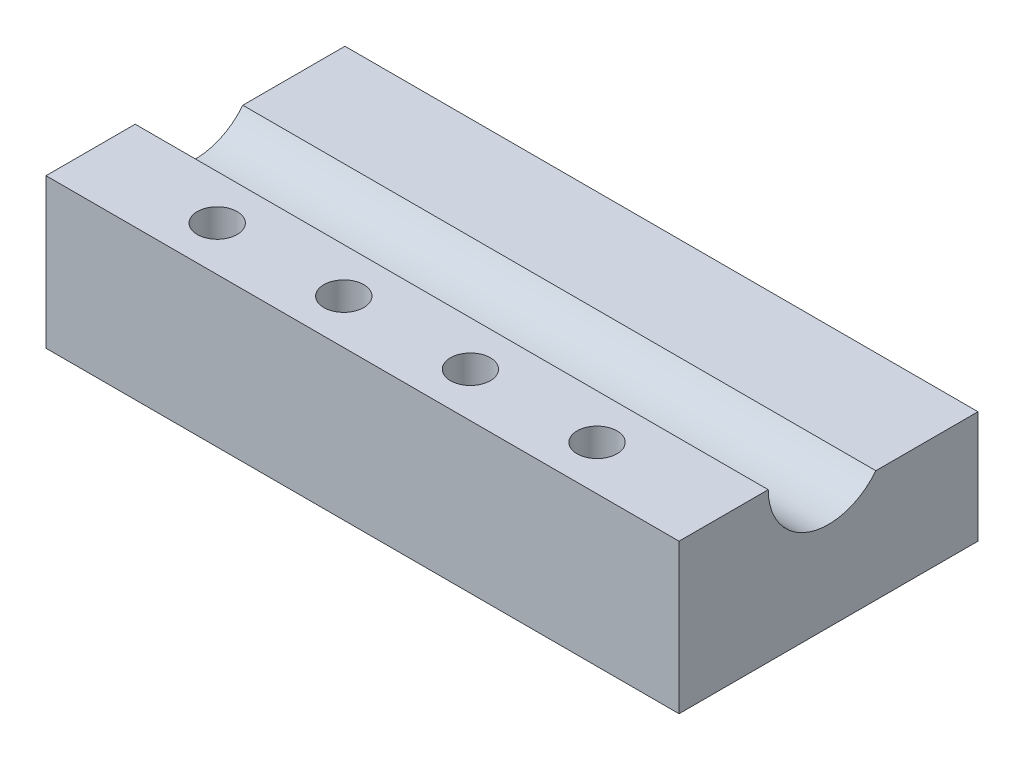
ISO-10303-21;
HEADER;
FILE_DESCRIPTION(('STEP AP214'),'2;1');
FILE_NAME('part.step','',(''),(''),'','','');
FILE_SCHEMA(('AUTOMOTIVE_DESIGN { 1 0 10303 214 1 1 1 1 }'));
ENDSEC;
DATA;
#1=APPLICATION_CONTEXT('core data for automotive mechanical design processes');
#2=APPLICATION_PROTOCOL_DEFINITION('international standard','automotive_design',2000,#1);
#3=PRODUCT_CONTEXT('',#1,'mechanical');
#4=PRODUCT('Part','Part','',(#3));
#5=PRODUCT_RELATED_PRODUCT_CATEGORY('part','',(#4));
#6=PRODUCT_DEFINITION_FORMATION('','',#4);
#7=PRODUCT_DEFINITION_CONTEXT('part definition',#1,'design');
#8=PRODUCT_DEFINITION('design','',#6,#7);
#9=PRODUCT_DEFINITION_SHAPE('','',#8);
#10=(LENGTH_UNIT() NAMED_UNIT(*) SI_UNIT(.MILLI.,.METRE.));
#11=(NAMED_UNIT(*) PLANE_ANGLE_UNIT() SI_UNIT($,.RADIAN.));
#12=(NAMED_UNIT(*) SI_UNIT($,.STERADIAN.) SOLID_ANGLE_UNIT());
#13=UNCERTAINTY_MEASURE_WITH_UNIT(LENGTH_MEASURE(1.E-05),#10,'distance_accuracy_value','');
#14=(GEOMETRIC_REPRESENTATION_CONTEXT(3) GLOBAL_UNCERTAINTY_ASSIGNED_CONTEXT((#13)) GLOBAL_UNIT_ASSIGNED_CONTEXT((#10,
#11,#12)) REPRESENTATION_CONTEXT('',''));
#15=CARTESIAN_POINT('',(0.,0.,0.));
#16=DIRECTION('',(0.,0.,1.));
#17=DIRECTION('',(1.,0.,0.));
#18=AXIS2_PLACEMENT_3D('',#15,#16,#17);
#19=CARTESIAN_POINT('',(0.,6.,0.));
#20=DIRECTION('',(0.,0.,-1.));
#21=DIRECTION('',(-1.,0.,0.));
#22=AXIS2_PLACEMENT_3D('',#19,#20,#21);
#23=PLANE('',#22);
#24=DIRECTION('',(1.,0.,0.));
#25=VECTOR('',#24,1.);
#26=CARTESIAN_POINT('',(0.,0.,0.));
#27=LINE('',#26,#25);
#28=CARTESIAN_POINT('',(0.,0.,0.));
#29=VERTEX_POINT('',#28);
#30=CARTESIAN_POINT('',(25.41,0.,0.));
#31=VERTEX_POINT('',#30);
#32=EDGE_CURVE('E144',#29,#31,#27,.T.);
#33=ORIENTED_EDGE('',*,*,#32,.T.);
#34=DIRECTION('',(0.,-1.,0.));
#35=VECTOR('',#34,1.);
#36=CARTESIAN_POINT('',(25.41,6.,0.));
#37=LINE('',#36,#35);
#38=CARTESIAN_POINT('',(25.41,6.,0.));
#39=VERTEX_POINT('',#38);
#40=EDGE_CURVE('E113',#39,#31,#37,.T.);
#41=ORIENTED_EDGE('',*,*,#40,.F.);
#42=DIRECTION('',(1.,0.,0.));
#43=VECTOR('',#42,1.);
#44=CARTESIAN_POINT('',(0.,6.,0.));
#45=LINE('',#44,#43);
#46=CARTESIAN_POINT('',(0.,6.,0.));
#47=VERTEX_POINT('',#46);
#48=EDGE_CURVE('E132',#47,#39,#45,.T.);
#49=ORIENTED_EDGE('',*,*,#48,.F.);
#50=DIRECTION('',(0.,-1.,0.));
#51=VECTOR('',#50,1.);
#52=CARTESIAN_POINT('',(0.,6.,0.));
#53=LINE('',#52,#51);
#54=EDGE_CURVE('E118',#47,#29,#53,.T.);
#55=ORIENTED_EDGE('',*,*,#54,.T.);
#56=EDGE_LOOP('',(#33,#41,#49,#55));
#57=FACE_BOUND('',#56,.T.);
#58=ADVANCED_FACE('F39',(#57),#23,.F.);
#59=CARTESIAN_POINT('',(25.41,6.,0.));
#60=DIRECTION('',(-1.,0.,0.));
#61=DIRECTION('',(0.,0.,1.));
#62=AXIS2_PLACEMENT_3D('',#59,#60,#61);
#63=PLANE('',#62);
#64=DIRECTION('',(0.,-1.,0.));
#65=VECTOR('',#64,1.);
#66=CARTESIAN_POINT('',(25.41,6.,-12.));
#67=LINE('',#66,#65);
#68=CARTESIAN_POINT('',(25.41,4.5,-12.));
#69=VERTEX_POINT('',#68);
#70=CARTESIAN_POINT('',(25.41,0.,-12.));
#71=VERTEX_POINT('',#70);
#72=EDGE_CURVE('E103',#69,#71,#67,.T.);
#73=ORIENTED_EDGE('',*,*,#72,.F.);
#74=DIRECTION('',(0.,0.,1.));
#75=VECTOR('',#74,1.);
#76=CARTESIAN_POINT('',(25.41,4.5,-12.));
#77=LINE('',#76,#75);
#78=CARTESIAN_POINT('',(25.41,4.5,-7.89905239527508));
#79=VERTEX_POINT('',#78);
#80=EDGE_CURVE('E90',#69,#79,#77,.T.);
#81=ORIENTED_EDGE('',*,*,#80,.T.);
#82=CARTESIAN_POINT('',(25.41,6.,-6.));
#83=DIRECTION('',(-1.,0.,0.));
#84=DIRECTION('',(0.,0.,1.));
#85=AXIS2_PLACEMENT_3D('',#82,#83,#84);
#86=CIRCLE('',#85,2.42);
#87=CARTESIAN_POINT('',(25.41,6.,-3.58));
#88=VERTEX_POINT('',#87);
#89=EDGE_CURVE('E124',#79,#88,#86,.T.);
#90=ORIENTED_EDGE('',*,*,#89,.T.);
#91=DIRECTION('',(0.,0.,-1.));
#92=VECTOR('',#91,1.);
#93=CARTESIAN_POINT('',(25.41,6.,0.));
#94=LINE('',#93,#92);
#95=EDGE_CURVE('E129',#39,#88,#94,.T.);
#96=ORIENTED_EDGE('',*,*,#95,.F.);
#97=ORIENTED_EDGE('',*,*,#40,.T.);
#98=DIRECTION('',(0.,0.,-1.));
#99=VECTOR('',#98,1.);
#100=CARTESIAN_POINT('',(25.41,0.,0.));
#101=LINE('',#100,#99);
#102=EDGE_CURVE('E110',#31,#71,#101,.T.);
#103=ORIENTED_EDGE('',*,*,#102,.T.);
#104=EDGE_LOOP('',(#73,#81,#90,#96,#97,#103));
#105=FACE_BOUND('',#104,.T.);
#106=ADVANCED_FACE('F108',(#105),#63,.F.);
#107=CARTESIAN_POINT('',(0.,6.,-12.));
#108=DIRECTION('',(0.,0.,-1.));
#109=DIRECTION('',(-1.,0.,0.));
#110=AXIS2_PLACEMENT_3D('',#107,#108,#109);
#111=PLANE('',#110);
#112=DIRECTION('',(-1.,0.,0.));
#113=VECTOR('',#112,1.);
#114=CARTESIAN_POINT('',(25.41,4.5,-12.));
#115=LINE('',#114,#113);
#116=CARTESIAN_POINT('',(0.,4.5,-12.));
#117=VERTEX_POINT('',#116);
#118=EDGE_CURVE('E93',#69,#117,#115,.T.);
#119=ORIENTED_EDGE('',*,*,#118,.F.);
#120=ORIENTED_EDGE('',*,*,#72,.T.);
#121=DIRECTION('',(1.,0.,0.));
#122=VECTOR('',#121,1.);
#123=CARTESIAN_POINT('',(0.,0.,-12.));
#124=LINE('',#123,#122);
#125=CARTESIAN_POINT('',(0.,0.,-12.));
#126=VERTEX_POINT('',#125);
#127=EDGE_CURVE('E150',#126,#71,#124,.T.);
#128=ORIENTED_EDGE('',*,*,#127,.F.);
#129=DIRECTION('',(0.,-1.,0.));
#130=VECTOR('',#129,1.);
#131=CARTESIAN_POINT('',(0.,6.,-12.));
#132=LINE('',#131,#130);
#133=EDGE_CURVE('E105',#117,#126,#132,.T.);
#134=ORIENTED_EDGE('',*,*,#133,.F.);
#135=EDGE_LOOP('',(#119,#120,#128,#134));
#136=FACE_BOUND('',#135,.T.);
#137=ADVANCED_FACE('F101',(#136),#111,.T.);
#138=CARTESIAN_POINT('',(0.,6.,0.));
#139=DIRECTION('',(-1.,0.,0.));
#140=DIRECTION('',(0.,0.,1.));
#141=AXIS2_PLACEMENT_3D('',#138,#139,#140);
#142=PLANE('',#141);
#143=DIRECTION('',(0.,0.,1.));
#144=VECTOR('',#143,1.);
#145=CARTESIAN_POINT('',(0.,4.5,-12.));
#146=LINE('',#145,#144);
#147=CARTESIAN_POINT('',(0.,4.5,-7.89905239527508));
#148=VERTEX_POINT('',#147);
#149=EDGE_CURVE('E54',#117,#148,#146,.T.);
#150=ORIENTED_EDGE('',*,*,#149,.F.);
#151=ORIENTED_EDGE('',*,*,#133,.T.);
#152=DIRECTION('',(0.,0.,-1.));
#153=VECTOR('',#152,1.);
#154=CARTESIAN_POINT('',(0.,0.,0.));
#155=LINE('',#154,#153);
#156=EDGE_CURVE('E140',#29,#126,#155,.T.);
#157=ORIENTED_EDGE('',*,*,#156,.F.);
#158=ORIENTED_EDGE('',*,*,#54,.F.);
#159=DIRECTION('',(0.,0.,-1.));
#160=VECTOR('',#159,1.);
#161=CARTESIAN_POINT('',(0.,6.,0.));
#162=LINE('',#161,#160);
#163=CARTESIAN_POINT('',(0.,6.,-3.58));
#164=VERTEX_POINT('',#163);
#165=EDGE_CURVE('E135',#47,#164,#162,.T.);
#166=ORIENTED_EDGE('',*,*,#165,.T.);
#167=CARTESIAN_POINT('',(0.,6.,-6.));
#168=DIRECTION('',(-1.,0.,0.));
#169=DIRECTION('',(0.,0.,1.));
#170=AXIS2_PLACEMENT_3D('',#167,#168,#169);
#171=CIRCLE('',#170,2.42);
#172=EDGE_CURVE('E60',#148,#164,#171,.T.);
#173=ORIENTED_EDGE('',*,*,#172,.F.);
#174=EDGE_LOOP('',(#150,#151,#157,#158,#166,#173));
#175=FACE_BOUND('',#174,.T.);
#176=ADVANCED_FACE('F162',(#175),#142,.T.);
#177=CARTESIAN_POINT('',(0.,6.,0.));
#178=DIRECTION('',(0.,1.,0.));
#179=DIRECTION('',(0.,0.,1.));
#180=AXIS2_PLACEMENT_3D('',#177,#178,#179);
#181=PLANE('',#180);
#182=CARTESIAN_POINT('',(20.328,6.,-1.79));
#183=DIRECTION('',(0.,1.,0.));
#184=DIRECTION('',(0.,0.,1.));
#185=AXIS2_PLACEMENT_3D('',#182,#183,#184);
#186=CIRCLE('',#185,0.799999999999999);
#187=CARTESIAN_POINT('',(20.328,6.,-0.990000000000001));
#188=VERTEX_POINT('',#187);
#189=EDGE_CURVE('E168',#188,#188,#186,.T.);
#190=ORIENTED_EDGE('',*,*,#189,.F.);
#191=EDGE_LOOP('',(#190));
#192=FACE_BOUND('',#191,.T.);
#193=CARTESIAN_POINT('',(15.246,6.,-1.79));
#194=DIRECTION('',(0.,1.,0.));
#195=DIRECTION('',(0.,0.,1.));
#196=AXIS2_PLACEMENT_3D('',#193,#194,#195);
#197=CIRCLE('',#196,0.799999999999999);
#198=CARTESIAN_POINT('',(15.246,6.,-0.990000000000001));
#199=VERTEX_POINT('',#198);
#200=EDGE_CURVE('E194',#199,#199,#197,.T.);
#201=ORIENTED_EDGE('',*,*,#200,.F.);
#202=EDGE_LOOP('',(#201));
#203=FACE_BOUND('',#202,.T.);
#204=CARTESIAN_POINT('',(10.164,6.,-1.79));
#205=DIRECTION('',(0.,1.,0.));
#206=DIRECTION('',(0.,0.,1.));
#207=AXIS2_PLACEMENT_3D('',#204,#205,#206);
#208=CIRCLE('',#207,0.800000000000001);
#209=CARTESIAN_POINT('',(10.164,6.,-0.989999999999999));
#210=VERTEX_POINT('',#209);
#211=EDGE_CURVE('E186',#210,#210,#208,.T.);
#212=ORIENTED_EDGE('',*,*,#211,.F.);
#213=EDGE_LOOP('',(#212));
#214=FACE_BOUND('',#213,.T.);
#215=CARTESIAN_POINT('',(5.082,6.,-1.79));
#216=DIRECTION('',(0.,1.,0.));
#217=DIRECTION('',(0.,0.,1.));
#218=AXIS2_PLACEMENT_3D('',#215,#216,#217);
#219=CIRCLE('',#218,0.800000000000001);
#220=CARTESIAN_POINT('',(5.082,6.,-0.989999999999999));
#221=VERTEX_POINT('',#220);
#222=EDGE_CURVE('E178',#221,#221,#219,.T.);
#223=ORIENTED_EDGE('',*,*,#222,.F.);
#224=EDGE_LOOP('',(#223));
#225=FACE_BOUND('',#224,.T.);
#226=DIRECTION('',(-1.,0.,0.));
#227=VECTOR('',#226,1.);
#228=CARTESIAN_POINT('',(25.41,6.,-3.58));
#229=LINE('',#228,#227);
#230=EDGE_CURVE('E47',#164,#88,#229,.F.);
#231=ORIENTED_EDGE('',*,*,#230,.F.);
#232=ORIENTED_EDGE('',*,*,#165,.F.);
#233=ORIENTED_EDGE('',*,*,#48,.T.);
#234=ORIENTED_EDGE('',*,*,#95,.T.);
#235=EDGE_LOOP('',(#231,#232,#233,#234));
#236=FACE_BOUND('',#235,.T.);
#237=ADVANCED_FACE('F130',(#192,#203,#214,#225,#236),#181,.T.);
#238=CARTESIAN_POINT('',(0.,0.,0.));
#239=DIRECTION('',(0.,1.,0.));
#240=DIRECTION('',(0.,0.,1.));
#241=AXIS2_PLACEMENT_3D('',#238,#239,#240);
#242=PLANE('',#241);
#243=CARTESIAN_POINT('',(20.328,0.,-1.79));
#244=DIRECTION('',(0.,1.,0.));
#245=DIRECTION('',(0.,0.,1.));
#246=AXIS2_PLACEMENT_3D('',#243,#244,#245);
#247=CIRCLE('',#246,0.799999999999999);
#248=CARTESIAN_POINT('',(20.328,0.,-0.990000000000001));
#249=VERTEX_POINT('',#248);
#250=EDGE_CURVE('E164',#249,#249,#247,.T.);
#251=ORIENTED_EDGE('',*,*,#250,.T.);
#252=EDGE_LOOP('',(#251));
#253=FACE_BOUND('',#252,.T.);
#254=CARTESIAN_POINT('',(15.246,0.,-1.79));
#255=DIRECTION('',(0.,1.,0.));
#256=DIRECTION('',(0.,0.,1.));
#257=AXIS2_PLACEMENT_3D('',#254,#255,#256);
#258=CIRCLE('',#257,0.799999999999999);
#259=CARTESIAN_POINT('',(15.246,0.,-0.990000000000001));
#260=VERTEX_POINT('',#259);
#261=EDGE_CURVE('E190',#260,#260,#258,.T.);
#262=ORIENTED_EDGE('',*,*,#261,.T.);
#263=EDGE_LOOP('',(#262));
#264=FACE_BOUND('',#263,.T.);
#265=CARTESIAN_POINT('',(10.164,0.,-1.79));
#266=DIRECTION('',(0.,1.,0.));
#267=DIRECTION('',(0.,0.,1.));
#268=AXIS2_PLACEMENT_3D('',#265,#266,#267);
#269=CIRCLE('',#268,0.800000000000001);
#270=CARTESIAN_POINT('',(10.164,0.,-0.989999999999999));
#271=VERTEX_POINT('',#270);
#272=EDGE_CURVE('E182',#271,#271,#269,.T.);
#273=ORIENTED_EDGE('',*,*,#272,.T.);
#274=EDGE_LOOP('',(#273));
#275=FACE_BOUND('',#274,.T.);
#276=CARTESIAN_POINT('',(5.082,0.,-1.79));
#277=DIRECTION('',(0.,1.,0.));
#278=DIRECTION('',(0.,0.,1.));
#279=AXIS2_PLACEMENT_3D('',#276,#277,#278);
#280=CIRCLE('',#279,0.800000000000001);
#281=CARTESIAN_POINT('',(5.082,0.,-0.989999999999999));
#282=VERTEX_POINT('',#281);
#283=EDGE_CURVE('E174',#282,#282,#280,.T.);
#284=ORIENTED_EDGE('',*,*,#283,.T.);
#285=EDGE_LOOP('',(#284));
#286=FACE_BOUND('',#285,.T.);
#287=ORIENTED_EDGE('',*,*,#32,.F.);
#288=ORIENTED_EDGE('',*,*,#156,.T.);
#289=ORIENTED_EDGE('',*,*,#127,.T.);
#290=ORIENTED_EDGE('',*,*,#102,.F.);
#291=EDGE_LOOP('',(#287,#288,#289,#290));
#292=FACE_BOUND('',#291,.T.);
#293=ADVANCED_FACE('F161',(#253,#264,#275,#286,#292),#242,.F.);
#294=CARTESIAN_POINT('',(25.41,6.,-6.));
#295=DIRECTION('',(-1.,0.,0.));
#296=DIRECTION('',(0.,0.,1.));
#297=AXIS2_PLACEMENT_3D('',#294,#295,#296);
#298=CYLINDRICAL_SURFACE('',#297,2.42);
#299=ORIENTED_EDGE('',*,*,#89,.F.);
#300=DIRECTION('',(-1.,0.,0.));
#301=VECTOR('',#300,1.);
#302=CARTESIAN_POINT('',(25.41,4.5,-7.89905239527508));
#303=LINE('',#302,#301);
#304=EDGE_CURVE('E11',#79,#148,#303,.T.);
#305=ORIENTED_EDGE('',*,*,#304,.T.);
#306=ORIENTED_EDGE('',*,*,#172,.T.);
#307=ORIENTED_EDGE('',*,*,#230,.T.);
#308=EDGE_LOOP('',(#299,#305,#306,#307));
#309=FACE_BOUND('',#308,.T.);
#310=ADVANCED_FACE('F123',(#309),#298,.F.);
#311=CARTESIAN_POINT('',(25.41,4.5,-12.));
#312=DIRECTION('',(0.,-1.,0.));
#313=DIRECTION('',(0.,0.,-1.));
#314=AXIS2_PLACEMENT_3D('',#311,#312,#313);
#315=PLANE('',#314);
#316=ORIENTED_EDGE('',*,*,#80,.F.);
#317=ORIENTED_EDGE('',*,*,#118,.T.);
#318=ORIENTED_EDGE('',*,*,#149,.T.);
#319=ORIENTED_EDGE('',*,*,#304,.F.);
#320=EDGE_LOOP('',(#316,#317,#318,#319));
#321=FACE_BOUND('',#320,.T.);
#322=ADVANCED_FACE('F92',(#321),#315,.F.);
#323=CARTESIAN_POINT('',(5.082,0.,-1.79));
#324=DIRECTION('',(0.,1.,0.));
#325=DIRECTION('',(0.,0.,1.));
#326=AXIS2_PLACEMENT_3D('',#323,#324,#325);
#327=CYLINDRICAL_SURFACE('',#326,0.800000000000001);
#328=ORIENTED_EDGE('',*,*,#283,.F.);
#329=EDGE_LOOP('',(#328));
#330=FACE_BOUND('',#329,.T.);
#331=ORIENTED_EDGE('',*,*,#222,.T.);
#332=EDGE_LOOP('',(#331));
#333=FACE_BOUND('',#332,.T.);
#334=ADVANCED_FACE('F213',(#330,#333),#327,.F.);
#335=CARTESIAN_POINT('',(10.164,0.,-1.79));
#336=DIRECTION('',(0.,1.,0.));
#337=DIRECTION('',(0.,0.,1.));
#338=AXIS2_PLACEMENT_3D('',#335,#336,#337);
#339=CYLINDRICAL_SURFACE('',#338,0.800000000000001);
#340=ORIENTED_EDGE('',*,*,#272,.F.);
#341=EDGE_LOOP('',(#340));
#342=FACE_BOUND('',#341,.T.);
#343=ORIENTED_EDGE('',*,*,#211,.T.);
#344=EDGE_LOOP('',(#343));
#345=FACE_BOUND('',#344,.T.);
#346=ADVANCED_FACE('F215',(#342,#345),#339,.F.);
#347=CARTESIAN_POINT('',(15.246,0.,-1.79));
#348=DIRECTION('',(0.,1.,0.));
#349=DIRECTION('',(0.,0.,1.));
#350=AXIS2_PLACEMENT_3D('',#347,#348,#349);
#351=CYLINDRICAL_SURFACE('',#350,0.799999999999999);
#352=ORIENTED_EDGE('',*,*,#261,.F.);
#353=EDGE_LOOP('',(#352));
#354=FACE_BOUND('',#353,.T.);
#355=ORIENTED_EDGE('',*,*,#200,.T.);
#356=EDGE_LOOP('',(#355));
#357=FACE_BOUND('',#356,.T.);
#358=ADVANCED_FACE('F222',(#354,#357),#351,.F.);
#359=CARTESIAN_POINT('',(20.328,0.,-1.79));
#360=DIRECTION('',(0.,1.,0.));
#361=DIRECTION('',(0.,0.,1.));
#362=AXIS2_PLACEMENT_3D('',#359,#360,#361);
#363=CYLINDRICAL_SURFACE('',#362,0.799999999999999);
#364=ORIENTED_EDGE('',*,*,#250,.F.);
#365=EDGE_LOOP('',(#364));
#366=FACE_BOUND('',#365,.T.);
#367=ORIENTED_EDGE('',*,*,#189,.T.);
#368=EDGE_LOOP('',(#367));
#369=FACE_BOUND('',#368,.T.);
#370=ADVANCED_FACE('F202',(#366,#369),#363,.F.);
#371=CLOSED_SHELL('',(#58,#106,#137,#176,#237,#293,#310,#322,#334,#346,#358,#370));
#372=MANIFOLD_SOLID_BREP('B2',#371);
#373=ADVANCED_BREP_SHAPE_REPRESENTATION('',(#18,#372),#14);
#374=SHAPE_DEFINITION_REPRESENTATION(#9,#373);
ENDSEC;
END-ISO-10303-21;
